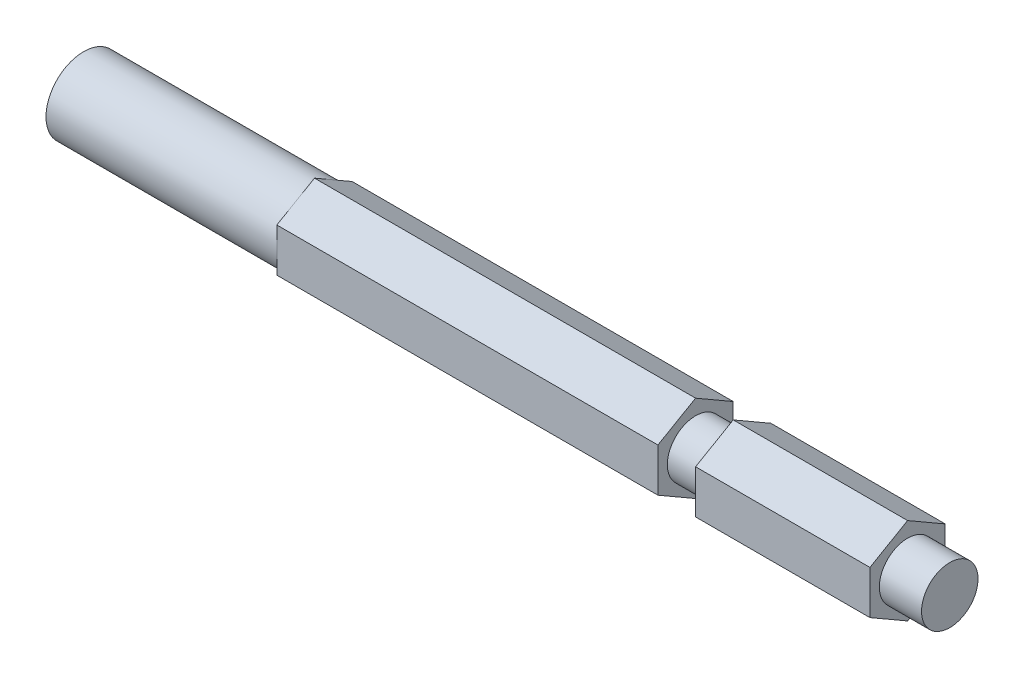
ISO-10303-21;
HEADER;
FILE_DESCRIPTION(('STEP AP214'),'2;1');
FILE_NAME('part.step','',(''),(''),'','','');
FILE_SCHEMA(('AUTOMOTIVE_DESIGN { 1 0 10303 214 1 1 1 1 }'));
ENDSEC;
DATA;
#1=APPLICATION_CONTEXT('core data for automotive mechanical design processes');
#2=APPLICATION_PROTOCOL_DEFINITION('international standard','automotive_design',2000,#1);
#3=PRODUCT_CONTEXT('',#1,'mechanical');
#4=PRODUCT('Part','Part','',(#3));
#5=PRODUCT_RELATED_PRODUCT_CATEGORY('part','',(#4));
#6=PRODUCT_DEFINITION_FORMATION('','',#4);
#7=PRODUCT_DEFINITION_CONTEXT('part definition',#1,'design');
#8=PRODUCT_DEFINITION('design','',#6,#7);
#9=PRODUCT_DEFINITION_SHAPE('','',#8);
#10=(LENGTH_UNIT() NAMED_UNIT(*) SI_UNIT(.MILLI.,.METRE.));
#11=(NAMED_UNIT(*) PLANE_ANGLE_UNIT() SI_UNIT($,.RADIAN.));
#12=(NAMED_UNIT(*) SI_UNIT($,.STERADIAN.) SOLID_ANGLE_UNIT());
#13=UNCERTAINTY_MEASURE_WITH_UNIT(LENGTH_MEASURE(1.E-05),#10,'distance_accuracy_value','');
#14=(GEOMETRIC_REPRESENTATION_CONTEXT(3) GLOBAL_UNCERTAINTY_ASSIGNED_CONTEXT((#13)) GLOBAL_UNIT_ASSIGNED_CONTEXT((#10,
#11,#12)) REPRESENTATION_CONTEXT('',''));
#15=CARTESIAN_POINT('',(0.,0.,0.));
#16=DIRECTION('',(0.,0.,1.));
#17=DIRECTION('',(1.,0.,0.));
#18=AXIS2_PLACEMENT_3D('',#15,#16,#17);
#19=CARTESIAN_POINT('',(38.9255,-7.33234841870825,0.));
#20=DIRECTION('',(0.,-0.866025403784439,-0.5));
#21=DIRECTION('',(0.,0.5,-0.866025403784439));
#22=AXIS2_PLACEMENT_3D('',#19,#20,#21);
#23=PLANE('',#22);
#24=DIRECTION('',(1.,0.,0.));
#25=VECTOR('',#24,1.);
#26=CARTESIAN_POINT('',(38.9255,-3.66617420935412,-6.35));
#27=LINE('',#26,#25);
#28=CARTESIAN_POINT('',(38.9255,-3.66617420935412,-6.35));
#29=VERTEX_POINT('',#28);
#30=CARTESIAN_POINT('',(103.1875,-3.66617420935412,-6.35));
#31=VERTEX_POINT('',#30);
#32=EDGE_CURVE('E178',#29,#31,#27,.T.);
#33=ORIENTED_EDGE('',*,*,#32,.T.);
#34=DIRECTION('',(0.,-0.5,0.866025403784439));
#35=VECTOR('',#34,1.);
#36=CARTESIAN_POINT('',(103.1875,-7.33234841870825,0.));
#37=LINE('',#36,#35);
#38=CARTESIAN_POINT('',(103.1875,-7.33234841870825,0.));
#39=VERTEX_POINT('',#38);
#40=EDGE_CURVE('E55',#31,#39,#37,.T.);
#41=ORIENTED_EDGE('',*,*,#40,.T.);
#42=DIRECTION('',(1.,0.,0.));
#43=VECTOR('',#42,1.);
#44=CARTESIAN_POINT('',(38.9255,-7.33234841870825,0.));
#45=LINE('',#44,#43);
#46=CARTESIAN_POINT('',(38.9255,-7.33234841870825,0.));
#47=VERTEX_POINT('',#46);
#48=EDGE_CURVE('E203',#47,#39,#45,.T.);
#49=ORIENTED_EDGE('',*,*,#48,.F.);
#50=DIRECTION('',(0.,0.5,-0.866025403784438));
#51=VECTOR('',#50,1.);
#52=CARTESIAN_POINT('',(38.9255,-7.33234841870825,0.));
#53=LINE('',#52,#51);
#54=CARTESIAN_POINT('',(38.9255,-5.49926131403118,-3.175));
#55=VERTEX_POINT('',#54);
#56=EDGE_CURVE('E241',#47,#55,#53,.T.);
#57=ORIENTED_EDGE('',*,*,#56,.T.);
#58=EDGE_CURVE('E293',#55,#29,#53,.T.);
#59=ORIENTED_EDGE('',*,*,#58,.T.);
#60=EDGE_LOOP('',(#33,#41,#49,#57,#59));
#61=FACE_BOUND('',#60,.T.);
#62=ADVANCED_FACE('F40',(#61),#23,.T.);
#63=CARTESIAN_POINT('',(38.9255,-3.66617420935412,6.35));
#64=DIRECTION('',(0.,-0.866025403784438,0.500000000000001));
#65=DIRECTION('',(0.,-0.500000000000001,-0.866025403784438));
#66=AXIS2_PLACEMENT_3D('',#63,#64,#65);
#67=PLANE('',#66);
#68=ORIENTED_EDGE('',*,*,#48,.T.);
#69=DIRECTION('',(0.,0.500000000000001,0.866025403784438));
#70=VECTOR('',#69,1.);
#71=CARTESIAN_POINT('',(103.1875,-3.66617420935412,6.35));
#72=LINE('',#71,#70);
#73=CARTESIAN_POINT('',(103.1875,-3.66617420935412,6.35));
#74=VERTEX_POINT('',#73);
#75=EDGE_CURVE('E251',#39,#74,#72,.T.);
#76=ORIENTED_EDGE('',*,*,#75,.T.);
#77=DIRECTION('',(1.,0.,0.));
#78=VECTOR('',#77,1.);
#79=CARTESIAN_POINT('',(38.9255,-3.66617420935412,6.35));
#80=LINE('',#79,#78);
#81=CARTESIAN_POINT('',(38.9255,-3.66617420935412,6.35));
#82=VERTEX_POINT('',#81);
#83=EDGE_CURVE('E250',#82,#74,#80,.T.);
#84=ORIENTED_EDGE('',*,*,#83,.F.);
#85=DIRECTION('',(0.,-0.500000000000001,-0.866025403784438));
#86=VECTOR('',#85,1.);
#87=CARTESIAN_POINT('',(38.9255,-3.66617420935412,6.35));
#88=LINE('',#87,#86);
#89=CARTESIAN_POINT('',(38.9255,-5.49926131403119,3.17500000000001));
#90=VERTEX_POINT('',#89);
#91=EDGE_CURVE('E179',#82,#90,#88,.T.);
#92=ORIENTED_EDGE('',*,*,#91,.T.);
#93=EDGE_CURVE('E184',#90,#47,#88,.T.);
#94=ORIENTED_EDGE('',*,*,#93,.T.);
#95=EDGE_LOOP('',(#68,#76,#84,#92,#94));
#96=FACE_BOUND('',#95,.T.);
#97=ADVANCED_FACE('F247',(#96),#67,.T.);
#98=CARTESIAN_POINT('',(38.9255,3.66617420935413,6.35));
#99=DIRECTION('',(0.,0.,1.));
#100=DIRECTION('',(0.,-1.,0.));
#101=AXIS2_PLACEMENT_3D('',#98,#99,#100);
#102=PLANE('',#101);
#103=ORIENTED_EDGE('',*,*,#83,.T.);
#104=DIRECTION('',(0.,1.,0.));
#105=VECTOR('',#104,1.);
#106=CARTESIAN_POINT('',(103.1875,3.66617420935413,6.35));
#107=LINE('',#106,#105);
#108=CARTESIAN_POINT('',(103.1875,3.66617420935413,6.35));
#109=VERTEX_POINT('',#108);
#110=EDGE_CURVE('E323',#74,#109,#107,.T.);
#111=ORIENTED_EDGE('',*,*,#110,.T.);
#112=DIRECTION('',(1.,0.,0.));
#113=VECTOR('',#112,1.);
#114=CARTESIAN_POINT('',(38.9255,3.66617420935413,6.35));
#115=LINE('',#114,#113);
#116=CARTESIAN_POINT('',(38.9255,3.66617420935413,6.35));
#117=VERTEX_POINT('',#116);
#118=EDGE_CURVE('E257',#117,#109,#115,.T.);
#119=ORIENTED_EDGE('',*,*,#118,.F.);
#120=DIRECTION('',(0.,-1.,0.));
#121=VECTOR('',#120,1.);
#122=CARTESIAN_POINT('',(38.9255,3.66617420935413,6.35));
#123=LINE('',#122,#121);
#124=CARTESIAN_POINT('',(38.9255,0.,6.35));
#125=VERTEX_POINT('',#124);
#126=EDGE_CURVE('E245',#117,#125,#123,.T.);
#127=ORIENTED_EDGE('',*,*,#126,.T.);
#128=EDGE_CURVE('E234',#125,#82,#123,.T.);
#129=ORIENTED_EDGE('',*,*,#128,.T.);
#130=EDGE_LOOP('',(#103,#111,#119,#127,#129));
#131=FACE_BOUND('',#130,.T.);
#132=ADVANCED_FACE('F362',(#131),#102,.T.);
#133=CARTESIAN_POINT('',(38.9255,7.33234841870825,0.));
#134=DIRECTION('',(0.,0.866025403784439,0.5));
#135=DIRECTION('',(0.,-0.5,0.866025403784439));
#136=AXIS2_PLACEMENT_3D('',#133,#134,#135);
#137=PLANE('',#136);
#138=ORIENTED_EDGE('',*,*,#118,.T.);
#139=DIRECTION('',(0.,0.5,-0.866025403784439));
#140=VECTOR('',#139,1.);
#141=CARTESIAN_POINT('',(103.1875,7.33234841870825,0.));
#142=LINE('',#141,#140);
#143=CARTESIAN_POINT('',(103.1875,7.33234841870825,0.));
#144=VERTEX_POINT('',#143);
#145=EDGE_CURVE('E325',#109,#144,#142,.T.);
#146=ORIENTED_EDGE('',*,*,#145,.T.);
#147=DIRECTION('',(1.,0.,0.));
#148=VECTOR('',#147,1.);
#149=CARTESIAN_POINT('',(38.9255,7.33234841870825,0.));
#150=LINE('',#149,#148);
#151=CARTESIAN_POINT('',(38.9255,7.33234841870825,0.));
#152=VERTEX_POINT('',#151);
#153=EDGE_CURVE('E262',#152,#144,#150,.T.);
#154=ORIENTED_EDGE('',*,*,#153,.F.);
#155=DIRECTION('',(0.,-0.5,0.866025403784439));
#156=VECTOR('',#155,1.);
#157=CARTESIAN_POINT('',(38.9255,7.33234841870825,0.));
#158=LINE('',#157,#156);
#159=CARTESIAN_POINT('',(38.9255,5.49926131403119,3.175));
#160=VERTEX_POINT('',#159);
#161=EDGE_CURVE('E311',#152,#160,#158,.T.);
#162=ORIENTED_EDGE('',*,*,#161,.T.);
#163=EDGE_CURVE('E310',#160,#117,#158,.T.);
#164=ORIENTED_EDGE('',*,*,#163,.T.);
#165=EDGE_LOOP('',(#138,#146,#154,#162,#164));
#166=FACE_BOUND('',#165,.T.);
#167=ADVANCED_FACE('F384',(#166),#137,.T.);
#168=CARTESIAN_POINT('',(38.9255,3.66617420935412,-6.35));
#169=DIRECTION('',(0.,0.866025403784438,-0.5));
#170=DIRECTION('',(0.,0.5,0.866025403784438));
#171=AXIS2_PLACEMENT_3D('',#168,#169,#170);
#172=PLANE('',#171);
#173=ORIENTED_EDGE('',*,*,#153,.T.);
#174=DIRECTION('',(0.,-0.5,-0.866025403784438));
#175=VECTOR('',#174,1.);
#176=CARTESIAN_POINT('',(103.1875,3.66617420935412,-6.35));
#177=LINE('',#176,#175);
#178=CARTESIAN_POINT('',(103.1875,3.66617420935412,-6.35));
#179=VERTEX_POINT('',#178);
#180=EDGE_CURVE('E171',#144,#179,#177,.T.);
#181=ORIENTED_EDGE('',*,*,#180,.T.);
#182=DIRECTION('',(1.,0.,0.));
#183=VECTOR('',#182,1.);
#184=CARTESIAN_POINT('',(38.9255,3.66617420935412,-6.35));
#185=LINE('',#184,#183);
#186=CARTESIAN_POINT('',(38.9255,3.66617420935412,-6.35));
#187=VERTEX_POINT('',#186);
#188=EDGE_CURVE('E188',#187,#179,#185,.T.);
#189=ORIENTED_EDGE('',*,*,#188,.F.);
#190=DIRECTION('',(0.,0.5,0.866025403784438));
#191=VECTOR('',#190,1.);
#192=CARTESIAN_POINT('',(38.9255,3.66617420935412,-6.35));
#193=LINE('',#192,#191);
#194=CARTESIAN_POINT('',(38.9255,5.49926131403119,-3.175));
#195=VERTEX_POINT('',#194);
#196=EDGE_CURVE('E307',#187,#195,#193,.T.);
#197=ORIENTED_EDGE('',*,*,#196,.T.);
#198=EDGE_CURVE('E306',#195,#152,#193,.T.);
#199=ORIENTED_EDGE('',*,*,#198,.T.);
#200=EDGE_LOOP('',(#173,#181,#189,#197,#199));
#201=FACE_BOUND('',#200,.T.);
#202=ADVANCED_FACE('F386',(#201),#172,.T.);
#203=CARTESIAN_POINT('',(38.9255,-3.66617420935412,-6.35));
#204=DIRECTION('',(0.,0.,-1.));
#205=DIRECTION('',(0.,1.,0.));
#206=AXIS2_PLACEMENT_3D('',#203,#204,#205);
#207=PLANE('',#206);
#208=ORIENTED_EDGE('',*,*,#188,.T.);
#209=DIRECTION('',(0.,-1.,0.));
#210=VECTOR('',#209,1.);
#211=CARTESIAN_POINT('',(103.1875,-3.66617420935412,-6.35));
#212=LINE('',#211,#210);
#213=EDGE_CURVE('E11',#179,#31,#212,.T.);
#214=ORIENTED_EDGE('',*,*,#213,.T.);
#215=ORIENTED_EDGE('',*,*,#32,.F.);
#216=DIRECTION('',(0.,1.,0.));
#217=VECTOR('',#216,1.);
#218=CARTESIAN_POINT('',(38.9255,-3.66617420935412,-6.35));
#219=LINE('',#218,#217);
#220=CARTESIAN_POINT('',(38.9255,0.,-6.35));
#221=VERTEX_POINT('',#220);
#222=EDGE_CURVE('E303',#29,#221,#219,.T.);
#223=ORIENTED_EDGE('',*,*,#222,.T.);
#224=EDGE_CURVE('E298',#221,#187,#219,.T.);
#225=ORIENTED_EDGE('',*,*,#224,.T.);
#226=EDGE_LOOP('',(#208,#214,#215,#223,#225));
#227=FACE_BOUND('',#226,.T.);
#228=ADVANCED_FACE('F388',(#227),#207,.T.);
#229=CARTESIAN_POINT('',(146.05,0.,0.));
#230=DIRECTION('',(-1.,0.,0.));
#231=DIRECTION('',(0.,0.,1.));
#232=AXIS2_PLACEMENT_3D('',#229,#230,#231);
#233=CYLINDRICAL_SURFACE('',#232,6.35);
#234=DIRECTION('',(1.,0.,0.));
#235=VECTOR('',#234,1.);
#236=CARTESIAN_POINT('',(-366.500254841821,-4.12701150955507,-4.826));
#237=LINE('',#236,#235);
#238=CARTESIAN_POINT('',(0.,-4.12701150955507,-4.826));
#239=VERTEX_POINT('',#238);
#240=CARTESIAN_POINT('',(25.4,-4.12701150955507,-4.826));
#241=VERTEX_POINT('',#240);
#242=EDGE_CURVE('E199',#239,#241,#237,.T.);
#243=ORIENTED_EDGE('',*,*,#242,.T.);
#244=CARTESIAN_POINT('',(25.4,0.,0.));
#245=DIRECTION('',(1.,0.,0.));
#246=DIRECTION('',(0.,0.,-1.));
#247=AXIS2_PLACEMENT_3D('',#244,#245,#246);
#248=CIRCLE('',#247,6.35);
#249=CARTESIAN_POINT('',(25.4,4.12701150955507,-4.826));
#250=VERTEX_POINT('',#249);
#251=EDGE_CURVE('E196',#241,#250,#248,.T.);
#252=ORIENTED_EDGE('',*,*,#251,.T.);
#253=DIRECTION('',(1.,0.,0.));
#254=VECTOR('',#253,1.);
#255=CARTESIAN_POINT('',(-366.500254841821,4.12701150955507,-4.826));
#256=LINE('',#255,#254);
#257=CARTESIAN_POINT('',(0.,4.12701150955507,-4.826));
#258=VERTEX_POINT('',#257);
#259=EDGE_CURVE('E193',#258,#250,#256,.T.);
#260=ORIENTED_EDGE('',*,*,#259,.F.);
#261=CARTESIAN_POINT('',(0.,0.,0.));
#262=DIRECTION('',(1.,0.,0.));
#263=DIRECTION('',(0.,0.,-1.));
#264=AXIS2_PLACEMENT_3D('',#261,#262,#263);
#265=CIRCLE('',#264,6.35);
#266=EDGE_CURVE('E201',#258,#239,#265,.T.);
#267=ORIENTED_EDGE('',*,*,#266,.T.);
#268=EDGE_LOOP('',(#243,#252,#260,#267));
#269=FACE_BOUND('',#268,.T.);
#270=CARTESIAN_POINT('',(38.9255,0.,0.));
#271=DIRECTION('',(1.,0.,0.));
#272=DIRECTION('',(0.,0.,-1.));
#273=AXIS2_PLACEMENT_3D('',#270,#271,#272);
#274=CIRCLE('',#273,6.35);
#275=EDGE_CURVE('E163',#221,#195,#274,.T.);
#276=ORIENTED_EDGE('',*,*,#275,.F.);
#277=EDGE_CURVE('E206',#55,#221,#274,.T.);
#278=ORIENTED_EDGE('',*,*,#277,.F.);
#279=EDGE_CURVE('E208',#90,#55,#274,.T.);
#280=ORIENTED_EDGE('',*,*,#279,.F.);
#281=EDGE_CURVE('E214',#125,#90,#274,.T.);
#282=ORIENTED_EDGE('',*,*,#281,.F.);
#283=EDGE_CURVE('E221',#160,#125,#274,.T.);
#284=ORIENTED_EDGE('',*,*,#283,.F.);
#285=EDGE_CURVE('E216',#195,#160,#274,.T.);
#286=ORIENTED_EDGE('',*,*,#285,.F.);
#287=EDGE_LOOP('',(#276,#278,#280,#282,#284,#286));
#288=FACE_BOUND('',#287,.T.);
#289=ADVANCED_FACE('F42',(#269,#288),#233,.T.);
#290=CARTESIAN_POINT('',(0.,0.,0.));
#291=DIRECTION('',(1.,0.,0.));
#292=DIRECTION('',(0.,0.,-1.));
#293=AXIS2_PLACEMENT_3D('',#290,#291,#292);
#294=PLANE('',#293);
#295=DIRECTION('',(0.,-1.,0.));
#296=VECTOR('',#295,1.);
#297=CARTESIAN_POINT('',(0.,-4.12701150955507,-4.826));
#298=LINE('',#297,#296);
#299=EDGE_CURVE('E194',#258,#239,#298,.T.);
#300=ORIENTED_EDGE('',*,*,#299,.T.);
#301=ORIENTED_EDGE('',*,*,#266,.F.);
#302=EDGE_LOOP('',(#300,#301));
#303=FACE_BOUND('',#302,.T.);
#304=ADVANCED_FACE('F399',(#303),#294,.F.);
#305=CARTESIAN_POINT('',(-366.500254841821,-4.12701150955507,-4.826));
#306=DIRECTION('',(0.,0.,-1.));
#307=DIRECTION('',(-1.,0.,0.));
#308=AXIS2_PLACEMENT_3D('',#305,#306,#307);
#309=PLANE('',#308);
#310=ORIENTED_EDGE('',*,*,#299,.F.);
#311=ORIENTED_EDGE('',*,*,#259,.T.);
#312=DIRECTION('',(0.,-1.,0.));
#313=VECTOR('',#312,1.);
#314=CARTESIAN_POINT('',(25.4,-4.12701150955507,-4.826));
#315=LINE('',#314,#313);
#316=EDGE_CURVE('E190',#250,#241,#315,.T.);
#317=ORIENTED_EDGE('',*,*,#316,.T.);
#318=ORIENTED_EDGE('',*,*,#242,.F.);
#319=EDGE_LOOP('',(#310,#311,#317,#318));
#320=FACE_BOUND('',#319,.T.);
#321=ADVANCED_FACE('F417',(#320),#309,.T.);
#322=CARTESIAN_POINT('',(25.4,0.,0.));
#323=DIRECTION('',(1.,0.,0.));
#324=DIRECTION('',(0.,0.,-1.));
#325=AXIS2_PLACEMENT_3D('',#322,#323,#324);
#326=PLANE('',#325);
#327=ORIENTED_EDGE('',*,*,#251,.F.);
#328=ORIENTED_EDGE('',*,*,#316,.F.);
#329=EDGE_LOOP('',(#327,#328));
#330=FACE_BOUND('',#329,.T.);
#331=ADVANCED_FACE('F412',(#330),#326,.F.);
#332=CARTESIAN_POINT('',(38.9255,0.,0.));
#333=DIRECTION('',(1.,0.,0.));
#334=DIRECTION('',(0.,0.,-1.));
#335=AXIS2_PLACEMENT_3D('',#332,#333,#334);
#336=PLANE('',#335);
#337=ORIENTED_EDGE('',*,*,#224,.F.);
#338=ORIENTED_EDGE('',*,*,#275,.T.);
#339=ORIENTED_EDGE('',*,*,#196,.F.);
#340=EDGE_LOOP('',(#337,#338,#339));
#341=FACE_BOUND('',#340,.T.);
#342=ADVANCED_FACE('F355',(#341),#336,.F.);
#343=ORIENTED_EDGE('',*,*,#198,.F.);
#344=ORIENTED_EDGE('',*,*,#285,.T.);
#345=ORIENTED_EDGE('',*,*,#161,.F.);
#346=EDGE_LOOP('',(#343,#344,#345));
#347=FACE_BOUND('',#346,.T.);
#348=ADVANCED_FACE('F410',(#347),#336,.F.);
#349=ORIENTED_EDGE('',*,*,#163,.F.);
#350=ORIENTED_EDGE('',*,*,#283,.T.);
#351=ORIENTED_EDGE('',*,*,#126,.F.);
#352=EDGE_LOOP('',(#349,#350,#351));
#353=FACE_BOUND('',#352,.T.);
#354=ADVANCED_FACE('F409',(#353),#336,.F.);
#355=ORIENTED_EDGE('',*,*,#128,.F.);
#356=ORIENTED_EDGE('',*,*,#281,.T.);
#357=ORIENTED_EDGE('',*,*,#91,.F.);
#358=EDGE_LOOP('',(#355,#356,#357));
#359=FACE_BOUND('',#358,.T.);
#360=ADVANCED_FACE('F233',(#359),#336,.F.);
#361=ORIENTED_EDGE('',*,*,#93,.F.);
#362=ORIENTED_EDGE('',*,*,#279,.T.);
#363=ORIENTED_EDGE('',*,*,#56,.F.);
#364=EDGE_LOOP('',(#361,#362,#363));
#365=FACE_BOUND('',#364,.T.);
#366=ADVANCED_FACE('F239',(#365),#336,.F.);
#367=ORIENTED_EDGE('',*,*,#58,.F.);
#368=ORIENTED_EDGE('',*,*,#277,.T.);
#369=ORIENTED_EDGE('',*,*,#222,.F.);
#370=EDGE_LOOP('',(#367,#368,#369));
#371=FACE_BOUND('',#370,.T.);
#372=ADVANCED_FACE('F347',(#371),#336,.F.);
#373=CARTESIAN_POINT('',(103.1875,0.,0.));
#374=DIRECTION('',(1.,0.,0.));
#375=DIRECTION('',(0.,0.,-1.));
#376=AXIS2_PLACEMENT_3D('',#373,#374,#375);
#377=PLANE('',#376);
#378=ORIENTED_EDGE('',*,*,#213,.F.);
#379=ORIENTED_EDGE('',*,*,#180,.F.);
#380=ORIENTED_EDGE('',*,*,#145,.F.);
#381=ORIENTED_EDGE('',*,*,#110,.F.);
#382=ORIENTED_EDGE('',*,*,#75,.F.);
#383=ORIENTED_EDGE('',*,*,#40,.F.);
#384=EDGE_LOOP('',(#378,#379,#380,#381,#382,#383));
#385=FACE_BOUND('',#384,.T.);
#386=CARTESIAN_POINT('',(103.1875,0.,0.));
#387=DIRECTION('',(1.,0.,0.));
#388=DIRECTION('',(0.,0.,-1.));
#389=AXIS2_PLACEMENT_3D('',#386,#387,#388);
#390=CIRCLE('',#389,4.7625);
#391=CARTESIAN_POINT('',(103.1875,0.,-4.7625));
#392=VERTEX_POINT('',#391);
#393=EDGE_CURVE('E335',#392,#392,#390,.T.);
#394=ORIENTED_EDGE('',*,*,#393,.F.);
#395=EDGE_LOOP('',(#394));
#396=FACE_BOUND('',#395,.T.);
#397=ADVANCED_FACE('F345',(#385,#396),#377,.T.);
#398=CARTESIAN_POINT('',(109.5375,0.,0.));
#399=DIRECTION('',(1.,0.,0.));
#400=DIRECTION('',(0.,0.,-1.));
#401=AXIS2_PLACEMENT_3D('',#398,#399,#400);
#402=PLANE('',#401);
#403=DIRECTION('',(0.,-0.5,0.866025403784439));
#404=VECTOR('',#403,1.);
#405=CARTESIAN_POINT('',(109.5375,-7.33234841870825,0.));
#406=LINE('',#405,#404);
#407=CARTESIAN_POINT('',(109.5375,-3.66617420935412,-6.35));
#408=VERTEX_POINT('',#407);
#409=CARTESIAN_POINT('',(109.5375,-7.33234841870825,0.));
#410=VERTEX_POINT('',#409);
#411=EDGE_CURVE('E158',#408,#410,#406,.T.);
#412=ORIENTED_EDGE('',*,*,#411,.T.);
#413=DIRECTION('',(0.,0.500000000000001,0.866025403784438));
#414=VECTOR('',#413,1.);
#415=CARTESIAN_POINT('',(109.5375,-3.66617420935412,6.35));
#416=LINE('',#415,#414);
#417=CARTESIAN_POINT('',(109.5375,-3.66617420935412,6.35));
#418=VERTEX_POINT('',#417);
#419=EDGE_CURVE('E172',#410,#418,#416,.T.);
#420=ORIENTED_EDGE('',*,*,#419,.T.);
#421=DIRECTION('',(0.,1.,0.));
#422=VECTOR('',#421,1.);
#423=CARTESIAN_POINT('',(109.5375,3.66617420935413,6.35));
#424=LINE('',#423,#422);
#425=CARTESIAN_POINT('',(109.5375,3.66617420935413,6.35));
#426=VERTEX_POINT('',#425);
#427=EDGE_CURVE('E330',#418,#426,#424,.T.);
#428=ORIENTED_EDGE('',*,*,#427,.T.);
#429=DIRECTION('',(0.,0.5,-0.866025403784439));
#430=VECTOR('',#429,1.);
#431=CARTESIAN_POINT('',(109.5375,7.33234841870825,0.));
#432=LINE('',#431,#430);
#433=CARTESIAN_POINT('',(109.5375,7.33234841870825,0.));
#434=VERTEX_POINT('',#433);
#435=EDGE_CURVE('E332',#426,#434,#432,.T.);
#436=ORIENTED_EDGE('',*,*,#435,.T.);
#437=DIRECTION('',(0.,-0.5,-0.866025403784438));
#438=VECTOR('',#437,1.);
#439=CARTESIAN_POINT('',(109.5375,3.66617420935412,-6.35));
#440=LINE('',#439,#438);
#441=CARTESIAN_POINT('',(109.5375,3.66617420935412,-6.35));
#442=VERTEX_POINT('',#441);
#443=EDGE_CURVE('E62',#434,#442,#440,.T.);
#444=ORIENTED_EDGE('',*,*,#443,.T.);
#445=DIRECTION('',(0.,-1.,0.));
#446=VECTOR('',#445,1.);
#447=CARTESIAN_POINT('',(109.5375,-3.66617420935412,-6.35));
#448=LINE('',#447,#446);
#449=EDGE_CURVE('E48',#442,#408,#448,.T.);
#450=ORIENTED_EDGE('',*,*,#449,.T.);
#451=EDGE_LOOP('',(#412,#420,#428,#436,#444,#450));
#452=FACE_BOUND('',#451,.T.);
#453=CARTESIAN_POINT('',(109.5375,0.,0.));
#454=DIRECTION('',(1.,0.,0.));
#455=DIRECTION('',(0.,0.,-1.));
#456=AXIS2_PLACEMENT_3D('',#453,#454,#455);
#457=CIRCLE('',#456,4.7625);
#458=CARTESIAN_POINT('',(109.5375,0.,-4.7625));
#459=VERTEX_POINT('',#458);
#460=EDGE_CURVE('E336',#459,#459,#457,.T.);
#461=ORIENTED_EDGE('',*,*,#460,.T.);
#462=EDGE_LOOP('',(#461));
#463=FACE_BOUND('',#462,.T.);
#464=ADVANCED_FACE('F156',(#452,#463),#402,.F.);
#465=CARTESIAN_POINT('',(103.1875,0.,0.));
#466=DIRECTION('',(1.,0.,0.));
#467=DIRECTION('',(0.,0.,-1.));
#468=AXIS2_PLACEMENT_3D('',#465,#466,#467);
#469=CYLINDRICAL_SURFACE('',#468,4.7625);
#470=ORIENTED_EDGE('',*,*,#393,.T.);
#471=EDGE_LOOP('',(#470));
#472=FACE_BOUND('',#471,.T.);
#473=ORIENTED_EDGE('',*,*,#460,.F.);
#474=EDGE_LOOP('',(#473));
#475=FACE_BOUND('',#474,.T.);
#476=ADVANCED_FACE('F342',(#472,#475),#469,.T.);
#477=CARTESIAN_POINT('',(146.05,0.,0.));
#478=DIRECTION('',(1.,0.,0.));
#479=DIRECTION('',(0.,0.,-1.));
#480=AXIS2_PLACEMENT_3D('',#477,#478,#479);
#481=PLANE('',#480);
#482=CARTESIAN_POINT('',(146.05,0.,0.));
#483=DIRECTION('',(1.,0.,0.));
#484=DIRECTION('',(0.,0.,-1.));
#485=AXIS2_PLACEMENT_3D('',#482,#483,#484);
#486=CIRCLE('',#485,4.7625);
#487=CARTESIAN_POINT('',(146.05,0.,-4.7625));
#488=VERTEX_POINT('',#487);
#489=EDGE_CURVE('E315',#488,#488,#486,.T.);
#490=ORIENTED_EDGE('',*,*,#489,.T.);
#491=EDGE_LOOP('',(#490));
#492=FACE_BOUND('',#491,.T.);
#493=ADVANCED_FACE('F422',(#492),#481,.T.);
#494=CARTESIAN_POINT('',(120.977487757862,0.,0.));
#495=DIRECTION('',(1.,0.,0.));
#496=DIRECTION('',(0.,0.,-1.));
#497=AXIS2_PLACEMENT_3D('',#494,#495,#496);
#498=CYLINDRICAL_SURFACE('',#497,4.7625);
#499=CARTESIAN_POINT('',(138.938,0.,0.));
#500=DIRECTION('',(1.,0.,0.));
#501=DIRECTION('',(0.,0.,-1.));
#502=AXIS2_PLACEMENT_3D('',#499,#500,#501);
#503=CIRCLE('',#502,4.7625);
#504=CARTESIAN_POINT('',(138.938,0.,-4.7625));
#505=VERTEX_POINT('',#504);
#506=EDGE_CURVE('E301',#505,#505,#503,.F.);
#507=ORIENTED_EDGE('',*,*,#506,.F.);
#508=EDGE_LOOP('',(#507));
#509=FACE_BOUND('',#508,.T.);
#510=ORIENTED_EDGE('',*,*,#489,.F.);
#511=EDGE_LOOP('',(#510));
#512=FACE_BOUND('',#511,.T.);
#513=ADVANCED_FACE('F392',(#509,#512),#498,.T.);
#514=CARTESIAN_POINT('',(138.938,0.,0.));
#515=DIRECTION('',(1.,0.,0.));
#516=DIRECTION('',(0.,0.,-1.));
#517=AXIS2_PLACEMENT_3D('',#514,#515,#516);
#518=PLANE('',#517);
#519=DIRECTION('',(0.,0.5,0.866025403784438));
#520=VECTOR('',#519,1.);
#521=CARTESIAN_POINT('',(138.938,3.66617420935412,-6.35));
#522=LINE('',#521,#520);
#523=CARTESIAN_POINT('',(138.938,3.66617420935412,-6.35));
#524=VERTEX_POINT('',#523);
#525=CARTESIAN_POINT('',(138.938,7.33234841870825,0.));
#526=VERTEX_POINT('',#525);
#527=EDGE_CURVE('E279',#524,#526,#522,.T.);
#528=ORIENTED_EDGE('',*,*,#527,.T.);
#529=DIRECTION('',(0.,-0.5,0.866025403784439));
#530=VECTOR('',#529,1.);
#531=CARTESIAN_POINT('',(138.938,7.33234841870825,0.));
#532=LINE('',#531,#530);
#533=CARTESIAN_POINT('',(138.938,3.66617420935413,6.35));
#534=VERTEX_POINT('',#533);
#535=EDGE_CURVE('E285',#526,#534,#532,.T.);
#536=ORIENTED_EDGE('',*,*,#535,.T.);
#537=DIRECTION('',(0.,-1.,0.));
#538=VECTOR('',#537,1.);
#539=CARTESIAN_POINT('',(138.938,3.66617420935413,6.35));
#540=LINE('',#539,#538);
#541=CARTESIAN_POINT('',(138.938,-3.66617420935412,6.35));
#542=VERTEX_POINT('',#541);
#543=EDGE_CURVE('E287',#534,#542,#540,.T.);
#544=ORIENTED_EDGE('',*,*,#543,.T.);
#545=DIRECTION('',(0.,-0.500000000000001,-0.866025403784438));
#546=VECTOR('',#545,1.);
#547=CARTESIAN_POINT('',(138.938,-3.66617420935412,6.35));
#548=LINE('',#547,#546);
#549=CARTESIAN_POINT('',(138.938,-7.33234841870825,0.));
#550=VERTEX_POINT('',#549);
#551=EDGE_CURVE('E292',#542,#550,#548,.T.);
#552=ORIENTED_EDGE('',*,*,#551,.T.);
#553=DIRECTION('',(0.,0.5,-0.866025403784438));
#554=VECTOR('',#553,1.);
#555=CARTESIAN_POINT('',(138.938,-7.33234841870825,0.));
#556=LINE('',#555,#554);
#557=CARTESIAN_POINT('',(138.938,-3.66617420935412,-6.35));
#558=VERTEX_POINT('',#557);
#559=EDGE_CURVE('E282',#550,#558,#556,.T.);
#560=ORIENTED_EDGE('',*,*,#559,.T.);
#561=DIRECTION('',(0.,1.,0.));
#562=VECTOR('',#561,1.);
#563=CARTESIAN_POINT('',(138.938,-3.66617420935412,-6.35));
#564=LINE('',#563,#562);
#565=EDGE_CURVE('E177',#558,#524,#564,.T.);
#566=ORIENTED_EDGE('',*,*,#565,.T.);
#567=EDGE_LOOP('',(#528,#536,#544,#552,#560,#566));
#568=FACE_BOUND('',#567,.T.);
#569=ORIENTED_EDGE('',*,*,#506,.T.);
#570=EDGE_LOOP('',(#569));
#571=FACE_BOUND('',#570,.T.);
#572=ADVANCED_FACE('F276',(#568,#571),#518,.T.);
#573=ORIENTED_EDGE('',*,*,#449,.F.);
#574=EDGE_CURVE('E182',#442,#524,#185,.T.);
#575=ORIENTED_EDGE('',*,*,#574,.T.);
#576=ORIENTED_EDGE('',*,*,#565,.F.);
#577=EDGE_CURVE('E168',#408,#558,#27,.T.);
#578=ORIENTED_EDGE('',*,*,#577,.F.);
#579=EDGE_LOOP('',(#573,#575,#576,#578));
#580=FACE_BOUND('',#579,.T.);
#581=ADVANCED_FACE('F175',(#580),#207,.T.);
#582=ORIENTED_EDGE('',*,*,#443,.F.);
#583=EDGE_CURVE('E264',#434,#526,#150,.T.);
#584=ORIENTED_EDGE('',*,*,#583,.T.);
#585=ORIENTED_EDGE('',*,*,#527,.F.);
#586=ORIENTED_EDGE('',*,*,#574,.F.);
#587=EDGE_LOOP('',(#582,#584,#585,#586));
#588=FACE_BOUND('',#587,.T.);
#589=ADVANCED_FACE('F284',(#588),#172,.T.);
#590=ORIENTED_EDGE('',*,*,#435,.F.);
#591=EDGE_CURVE('E261',#426,#534,#115,.T.);
#592=ORIENTED_EDGE('',*,*,#591,.T.);
#593=ORIENTED_EDGE('',*,*,#535,.F.);
#594=ORIENTED_EDGE('',*,*,#583,.F.);
#595=EDGE_LOOP('',(#590,#592,#593,#594));
#596=FACE_BOUND('',#595,.T.);
#597=ADVANCED_FACE('F376',(#596),#137,.T.);
#598=ORIENTED_EDGE('',*,*,#427,.F.);
#599=EDGE_CURVE('E254',#418,#542,#80,.T.);
#600=ORIENTED_EDGE('',*,*,#599,.T.);
#601=ORIENTED_EDGE('',*,*,#543,.F.);
#602=ORIENTED_EDGE('',*,*,#591,.F.);
#603=EDGE_LOOP('',(#598,#600,#601,#602));
#604=FACE_BOUND('',#603,.T.);
#605=ADVANCED_FACE('F371',(#604),#102,.T.);
#606=ORIENTED_EDGE('',*,*,#419,.F.);
#607=EDGE_CURVE('E170',#410,#550,#45,.T.);
#608=ORIENTED_EDGE('',*,*,#607,.T.);
#609=ORIENTED_EDGE('',*,*,#551,.F.);
#610=ORIENTED_EDGE('',*,*,#599,.F.);
#611=EDGE_LOOP('',(#606,#608,#609,#610));
#612=FACE_BOUND('',#611,.T.);
#613=ADVANCED_FACE('F364',(#612),#67,.T.);
#614=ORIENTED_EDGE('',*,*,#411,.F.);
#615=ORIENTED_EDGE('',*,*,#577,.T.);
#616=ORIENTED_EDGE('',*,*,#559,.F.);
#617=ORIENTED_EDGE('',*,*,#607,.F.);
#618=EDGE_LOOP('',(#614,#615,#616,#617));
#619=FACE_BOUND('',#618,.T.);
#620=ADVANCED_FACE('F166',(#619),#23,.T.);
#621=CLOSED_SHELL('',(#62,#97,#132,#167,#202,#228,#289,#304,#321,#331,#342,#348,#354,#360,#366,
#372,#397,#464,#476,#493,#513,#572,#581,#589,#597,#605,#613,#620));
#622=MANIFOLD_SOLID_BREP('B2',#621);
#623=ADVANCED_BREP_SHAPE_REPRESENTATION('',(#18,#622),#14);
#624=SHAPE_DEFINITION_REPRESENTATION(#9,#623);
ENDSEC;
END-ISO-10303-21;
